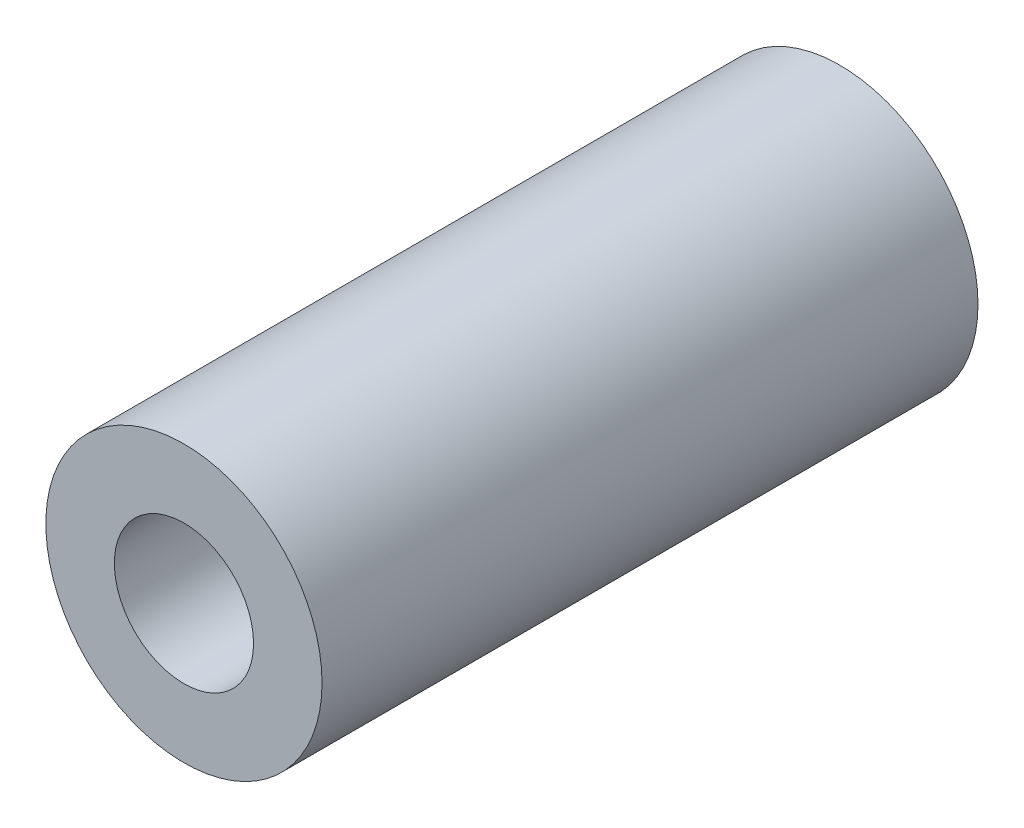
ISO-10303-21;
HEADER;
FILE_DESCRIPTION(('STEP AP214'),'2;1');
FILE_NAME('part.step','',(''),(''),'','','');
FILE_SCHEMA(('AUTOMOTIVE_DESIGN { 1 0 10303 214 1 1 1 1 }'));
ENDSEC;
DATA;
#1=APPLICATION_CONTEXT('core data for automotive mechanical design processes');
#2=APPLICATION_PROTOCOL_DEFINITION('international standard','automotive_design',2000,#1);
#3=PRODUCT_CONTEXT('',#1,'mechanical');
#4=PRODUCT('Part','Part','',(#3));
#5=PRODUCT_RELATED_PRODUCT_CATEGORY('part','',(#4));
#6=PRODUCT_DEFINITION_FORMATION('','',#4);
#7=PRODUCT_DEFINITION_CONTEXT('part definition',#1,'design');
#8=PRODUCT_DEFINITION('design','',#6,#7);
#9=PRODUCT_DEFINITION_SHAPE('','',#8);
#10=(LENGTH_UNIT() NAMED_UNIT(*) SI_UNIT(.MILLI.,.METRE.));
#11=(NAMED_UNIT(*) PLANE_ANGLE_UNIT() SI_UNIT($,.RADIAN.));
#12=(NAMED_UNIT(*) SI_UNIT($,.STERADIAN.) SOLID_ANGLE_UNIT());
#13=UNCERTAINTY_MEASURE_WITH_UNIT(LENGTH_MEASURE(1.E-05),#10,'distance_accuracy_value','');
#14=(GEOMETRIC_REPRESENTATION_CONTEXT(3) GLOBAL_UNCERTAINTY_ASSIGNED_CONTEXT((#13)) GLOBAL_UNIT_ASSIGNED_CONTEXT((#10,
#11,#12)) REPRESENTATION_CONTEXT('',''));
#15=CARTESIAN_POINT('',(0.,0.,0.));
#16=DIRECTION('',(0.,0.,1.));
#17=DIRECTION('',(1.,0.,0.));
#18=AXIS2_PLACEMENT_3D('',#15,#16,#17);
#19=CARTESIAN_POINT('',(0.,0.,15.08125));
#20=DIRECTION('',(0.,0.,1.));
#21=DIRECTION('',(1.,0.,0.));
#22=AXIS2_PLACEMENT_3D('',#19,#20,#21);
#23=PLANE('',#22);
#24=CARTESIAN_POINT('',(0.,0.,15.08125));
#25=DIRECTION('',(0.,0.,1.));
#26=DIRECTION('',(1.,0.,0.));
#27=AXIS2_PLACEMENT_3D('',#24,#25,#26);
#28=CIRCLE('',#27,6.35);
#29=CARTESIAN_POINT('',(6.35,0.,15.08125));
#30=VERTEX_POINT('',#29);
#31=EDGE_CURVE('E10',#30,#30,#28,.T.);
#32=ORIENTED_EDGE('',*,*,#31,.T.);
#33=EDGE_LOOP('',(#32));
#34=FACE_BOUND('',#33,.T.);
#35=CARTESIAN_POINT('',(0.,0.,15.08125));
#36=DIRECTION('',(0.,0.,1.));
#37=DIRECTION('',(1.,0.,0.));
#38=AXIS2_PLACEMENT_3D('',#35,#36,#37);
#39=CIRCLE('',#38,3.2004);
#40=CARTESIAN_POINT('',(3.2004,0.,15.08125));
#41=VERTEX_POINT('',#40);
#42=EDGE_CURVE('E43',#41,#41,#39,.T.);
#43=ORIENTED_EDGE('',*,*,#42,.F.);
#44=EDGE_LOOP('',(#43));
#45=FACE_BOUND('',#44,.T.);
#46=ADVANCED_FACE('F32',(#34,#45),#23,.T.);
#47=CARTESIAN_POINT('',(0.,0.,-15.08125));
#48=DIRECTION('',(0.,0.,1.));
#49=DIRECTION('',(1.,0.,0.));
#50=AXIS2_PLACEMENT_3D('',#47,#48,#49);
#51=PLANE('',#50);
#52=CARTESIAN_POINT('',(0.,0.,-15.08125));
#53=DIRECTION('',(0.,0.,1.));
#54=DIRECTION('',(1.,0.,0.));
#55=AXIS2_PLACEMENT_3D('',#52,#53,#54);
#56=CIRCLE('',#55,6.35);
#57=CARTESIAN_POINT('',(6.35,0.,-15.08125));
#58=VERTEX_POINT('',#57);
#59=EDGE_CURVE('E36',#58,#58,#56,.T.);
#60=ORIENTED_EDGE('',*,*,#59,.F.);
#61=EDGE_LOOP('',(#60));
#62=FACE_BOUND('',#61,.T.);
#63=CARTESIAN_POINT('',(0.,0.,-15.08125));
#64=DIRECTION('',(0.,0.,1.));
#65=DIRECTION('',(1.,0.,0.));
#66=AXIS2_PLACEMENT_3D('',#63,#64,#65);
#67=CIRCLE('',#66,3.2004);
#68=CARTESIAN_POINT('',(3.2004,0.,-15.08125));
#69=VERTEX_POINT('',#68);
#70=EDGE_CURVE('E45',#69,#69,#67,.T.);
#71=ORIENTED_EDGE('',*,*,#70,.T.);
#72=EDGE_LOOP('',(#71));
#73=FACE_BOUND('',#72,.T.);
#74=ADVANCED_FACE('F55',(#62,#73),#51,.F.);
#75=CARTESIAN_POINT('',(0.,0.,15.08125));
#76=DIRECTION('',(0.,0.,-1.));
#77=DIRECTION('',(-1.,0.,0.));
#78=AXIS2_PLACEMENT_3D('',#75,#76,#77);
#79=CYLINDRICAL_SURFACE('',#78,6.35);
#80=ORIENTED_EDGE('',*,*,#31,.F.);
#81=EDGE_LOOP('',(#80));
#82=FACE_BOUND('',#81,.T.);
#83=ORIENTED_EDGE('',*,*,#59,.T.);
#84=EDGE_LOOP('',(#83));
#85=FACE_BOUND('',#84,.T.);
#86=ADVANCED_FACE('F34',(#82,#85),#79,.T.);
#87=CARTESIAN_POINT('',(0.,0.,15.08125));
#88=DIRECTION('',(0.,0.,-1.));
#89=DIRECTION('',(-1.,0.,0.));
#90=AXIS2_PLACEMENT_3D('',#87,#88,#89);
#91=CYLINDRICAL_SURFACE('',#90,3.2004);
#92=ORIENTED_EDGE('',*,*,#42,.T.);
#93=EDGE_LOOP('',(#92));
#94=FACE_BOUND('',#93,.T.);
#95=ORIENTED_EDGE('',*,*,#70,.F.);
#96=EDGE_LOOP('',(#95));
#97=FACE_BOUND('',#96,.T.);
#98=ADVANCED_FACE('F51',(#94,#97),#91,.F.);
#99=CLOSED_SHELL('',(#46,#74,#86,#98));
#100=MANIFOLD_SOLID_BREP('B2',#99);
#101=ADVANCED_BREP_SHAPE_REPRESENTATION('',(#18,#100),#14);
#102=SHAPE_DEFINITION_REPRESENTATION(#9,#101);
ENDSEC;
END-ISO-10303-21;
